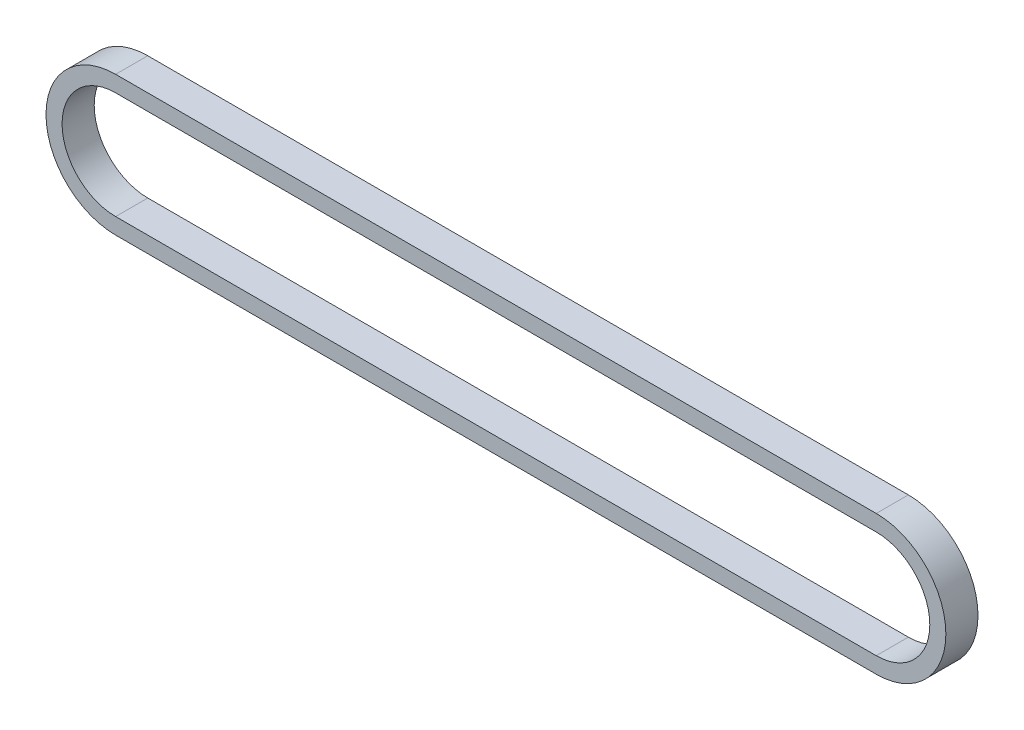
ISO-10303-21;
HEADER;
FILE_DESCRIPTION(('STEP AP214'),'2;1');
FILE_NAME('part.step','',(''),(''),'','','');
FILE_SCHEMA(('AUTOMOTIVE_DESIGN { 1 0 10303 214 1 1 1 1 }'));
ENDSEC;
DATA;
#1=APPLICATION_CONTEXT('core data for automotive mechanical design processes');
#2=APPLICATION_PROTOCOL_DEFINITION('international standard','automotive_design',2000,#1);
#3=PRODUCT_CONTEXT('',#1,'mechanical');
#4=PRODUCT('Part','Part','',(#3));
#5=PRODUCT_RELATED_PRODUCT_CATEGORY('part','',(#4));
#6=PRODUCT_DEFINITION_FORMATION('','',#4);
#7=PRODUCT_DEFINITION_CONTEXT('part definition',#1,'design');
#8=PRODUCT_DEFINITION('design','',#6,#7);
#9=PRODUCT_DEFINITION_SHAPE('','',#8);
#10=(LENGTH_UNIT() NAMED_UNIT(*) SI_UNIT(.MILLI.,.METRE.));
#11=(NAMED_UNIT(*) PLANE_ANGLE_UNIT() SI_UNIT($,.RADIAN.));
#12=(NAMED_UNIT(*) SI_UNIT($,.STERADIAN.) SOLID_ANGLE_UNIT());
#13=UNCERTAINTY_MEASURE_WITH_UNIT(LENGTH_MEASURE(1.E-05),#10,'distance_accuracy_value','');
#14=(GEOMETRIC_REPRESENTATION_CONTEXT(3) GLOBAL_UNCERTAINTY_ASSIGNED_CONTEXT((#13)) GLOBAL_UNIT_ASSIGNED_CONTEXT((#10,
#11,#12)) REPRESENTATION_CONTEXT('',''));
#15=CARTESIAN_POINT('',(0.,0.,0.));
#16=DIRECTION('',(0.,0.,1.));
#17=DIRECTION('',(1.,0.,0.));
#18=AXIS2_PLACEMENT_3D('',#15,#16,#17);
#19=CARTESIAN_POINT('',(-35.5,0.,3.));
#20=DIRECTION('',(0.,0.,1.));
#21=DIRECTION('',(1.,0.,0.));
#22=AXIS2_PLACEMENT_3D('',#19,#20,#21);
#23=PLANE('',#22);
#24=CARTESIAN_POINT('',(-35.5,0.,3.));
#25=DIRECTION('',(0.,0.,1.));
#26=DIRECTION('',(1.,0.,0.));
#27=AXIS2_PLACEMENT_3D('',#24,#25,#26);
#28=CIRCLE('',#27,6.50000000000001);
#29=CARTESIAN_POINT('',(-35.5,6.50000000000001,3.));
#30=VERTEX_POINT('',#29);
#31=CARTESIAN_POINT('',(-35.5,-6.50000000000001,3.));
#32=VERTEX_POINT('',#31);
#33=EDGE_CURVE('E167',#30,#32,#28,.T.);
#34=ORIENTED_EDGE('',*,*,#33,.T.);
#35=DIRECTION('',(1.,0.,0.));
#36=VECTOR('',#35,1.);
#37=CARTESIAN_POINT('',(-35.5,-6.50000000000001,3.));
#38=LINE('',#37,#36);
#39=CARTESIAN_POINT('',(35.5,-6.50000000000001,3.));
#40=VERTEX_POINT('',#39);
#41=EDGE_CURVE('E171',#32,#40,#38,.T.);
#42=ORIENTED_EDGE('',*,*,#41,.T.);
#43=CARTESIAN_POINT('',(35.5,0.,3.));
#44=DIRECTION('',(0.,0.,1.));
#45=DIRECTION('',(1.,0.,0.));
#46=AXIS2_PLACEMENT_3D('',#43,#44,#45);
#47=CIRCLE('',#46,6.50000000000001);
#48=CARTESIAN_POINT('',(35.5,6.50000000000003,3.));
#49=VERTEX_POINT('',#48);
#50=EDGE_CURVE('E174',#40,#49,#47,.T.);
#51=ORIENTED_EDGE('',*,*,#50,.T.);
#52=DIRECTION('',(-1.,0.,0.));
#53=VECTOR('',#52,1.);
#54=CARTESIAN_POINT('',(-35.5,6.50000000000001,3.));
#55=LINE('',#54,#53);
#56=EDGE_CURVE('E177',#49,#30,#55,.T.);
#57=ORIENTED_EDGE('',*,*,#56,.T.);
#58=EDGE_LOOP('',(#34,#42,#51,#57));
#59=FACE_BOUND('',#58,.T.);
#60=DIRECTION('',(1.,0.,0.));
#61=VECTOR('',#60,1.);
#62=CARTESIAN_POINT('',(-35.5,-5.00000000000001,3.));
#63=LINE('',#62,#61);
#64=CARTESIAN_POINT('',(-35.5,-5.00000000000001,3.));
#65=VERTEX_POINT('',#64);
#66=CARTESIAN_POINT('',(35.5,-5.00000000000001,3.));
#67=VERTEX_POINT('',#66);
#68=EDGE_CURVE('E126',#65,#67,#63,.T.);
#69=ORIENTED_EDGE('',*,*,#68,.F.);
#70=CARTESIAN_POINT('',(-35.5,0.,3.));
#71=DIRECTION('',(0.,0.,1.));
#72=DIRECTION('',(1.,0.,0.));
#73=AXIS2_PLACEMENT_3D('',#70,#71,#72);
#74=CIRCLE('',#73,5.00000000000001);
#75=CARTESIAN_POINT('',(-35.5,5.00000000000001,3.));
#76=VERTEX_POINT('',#75);
#77=EDGE_CURVE('E117',#76,#65,#74,.T.);
#78=ORIENTED_EDGE('',*,*,#77,.F.);
#79=DIRECTION('',(-1.,0.,0.));
#80=VECTOR('',#79,1.);
#81=CARTESIAN_POINT('',(-35.5,5.00000000000001,3.));
#82=LINE('',#81,#80);
#83=CARTESIAN_POINT('',(35.5,5.00000000000003,3.));
#84=VERTEX_POINT('',#83);
#85=EDGE_CURVE('E145',#84,#76,#82,.T.);
#86=ORIENTED_EDGE('',*,*,#85,.F.);
#87=CARTESIAN_POINT('',(35.5,0.,3.));
#88=DIRECTION('',(0.,0.,1.));
#89=DIRECTION('',(1.,0.,0.));
#90=AXIS2_PLACEMENT_3D('',#87,#88,#89);
#91=CIRCLE('',#90,5.00000000000001);
#92=EDGE_CURVE('E139',#67,#84,#91,.T.);
#93=ORIENTED_EDGE('',*,*,#92,.F.);
#94=EDGE_LOOP('',(#69,#78,#86,#93));
#95=FACE_BOUND('',#94,.T.);
#96=ADVANCED_FACE('F41',(#59,#95),#23,.T.);
#97=CARTESIAN_POINT('',(-35.5,0.,0.));
#98=DIRECTION('',(0.,0.,1.));
#99=DIRECTION('',(1.,0.,0.));
#100=AXIS2_PLACEMENT_3D('',#97,#98,#99);
#101=PLANE('',#100);
#102=CARTESIAN_POINT('',(-35.5,0.,0.));
#103=DIRECTION('',(0.,0.,1.));
#104=DIRECTION('',(1.,0.,0.));
#105=AXIS2_PLACEMENT_3D('',#102,#103,#104);
#106=CIRCLE('',#105,6.50000000000001);
#107=CARTESIAN_POINT('',(-35.5,6.50000000000001,0.));
#108=VERTEX_POINT('',#107);
#109=CARTESIAN_POINT('',(-35.5,-6.50000000000001,0.));
#110=VERTEX_POINT('',#109);
#111=EDGE_CURVE('E135',#108,#110,#106,.T.);
#112=ORIENTED_EDGE('',*,*,#111,.F.);
#113=DIRECTION('',(-1.,0.,0.));
#114=VECTOR('',#113,1.);
#115=CARTESIAN_POINT('',(-35.5,6.50000000000001,0.));
#116=LINE('',#115,#114);
#117=CARTESIAN_POINT('',(35.5,6.50000000000003,0.));
#118=VERTEX_POINT('',#117);
#119=EDGE_CURVE('E172',#118,#108,#116,.T.);
#120=ORIENTED_EDGE('',*,*,#119,.F.);
#121=CARTESIAN_POINT('',(35.5,0.,0.));
#122=DIRECTION('',(0.,0.,1.));
#123=DIRECTION('',(1.,0.,0.));
#124=AXIS2_PLACEMENT_3D('',#121,#122,#123);
#125=CIRCLE('',#124,6.50000000000001);
#126=CARTESIAN_POINT('',(35.5,-6.50000000000001,0.));
#127=VERTEX_POINT('',#126);
#128=EDGE_CURVE('E186',#127,#118,#125,.T.);
#129=ORIENTED_EDGE('',*,*,#128,.F.);
#130=DIRECTION('',(1.,0.,0.));
#131=VECTOR('',#130,1.);
#132=CARTESIAN_POINT('',(-35.5,-6.50000000000001,0.));
#133=LINE('',#132,#131);
#134=EDGE_CURVE('E184',#110,#127,#133,.T.);
#135=ORIENTED_EDGE('',*,*,#134,.F.);
#136=EDGE_LOOP('',(#112,#120,#129,#135));
#137=FACE_BOUND('',#136,.T.);
#138=CARTESIAN_POINT('',(-35.5,0.,0.));
#139=DIRECTION('',(0.,0.,1.));
#140=DIRECTION('',(1.,0.,0.));
#141=AXIS2_PLACEMENT_3D('',#138,#139,#140);
#142=CIRCLE('',#141,5.00000000000001);
#143=CARTESIAN_POINT('',(-35.5,5.00000000000001,0.));
#144=VERTEX_POINT('',#143);
#145=CARTESIAN_POINT('',(-35.5,-5.00000000000001,0.));
#146=VERTEX_POINT('',#145);
#147=EDGE_CURVE('E67',#144,#146,#142,.T.);
#148=ORIENTED_EDGE('',*,*,#147,.T.);
#149=DIRECTION('',(1.,0.,0.));
#150=VECTOR('',#149,1.);
#151=CARTESIAN_POINT('',(-35.5,-5.00000000000001,0.));
#152=LINE('',#151,#150);
#153=CARTESIAN_POINT('',(35.5,-5.00000000000001,0.));
#154=VERTEX_POINT('',#153);
#155=EDGE_CURVE('E133',#146,#154,#152,.T.);
#156=ORIENTED_EDGE('',*,*,#155,.T.);
#157=CARTESIAN_POINT('',(35.5,0.,0.));
#158=DIRECTION('',(0.,0.,1.));
#159=DIRECTION('',(1.,0.,0.));
#160=AXIS2_PLACEMENT_3D('',#157,#158,#159);
#161=CIRCLE('',#160,5.00000000000001);
#162=CARTESIAN_POINT('',(35.5,5.00000000000003,0.));
#163=VERTEX_POINT('',#162);
#164=EDGE_CURVE('E154',#154,#163,#161,.T.);
#165=ORIENTED_EDGE('',*,*,#164,.T.);
#166=DIRECTION('',(-1.,0.,0.));
#167=VECTOR('',#166,1.);
#168=CARTESIAN_POINT('',(-35.5,5.00000000000001,0.));
#169=LINE('',#168,#167);
#170=EDGE_CURVE('E127',#163,#144,#169,.T.);
#171=ORIENTED_EDGE('',*,*,#170,.T.);
#172=EDGE_LOOP('',(#148,#156,#165,#171));
#173=FACE_BOUND('',#172,.T.);
#174=ADVANCED_FACE('F209',(#137,#173),#101,.F.);
#175=CARTESIAN_POINT('',(-35.5,0.,3.));
#176=DIRECTION('',(0.,0.,-1.));
#177=DIRECTION('',(-1.,0.,0.));
#178=AXIS2_PLACEMENT_3D('',#175,#176,#177);
#179=CYLINDRICAL_SURFACE('',#178,6.50000000000001);
#180=ORIENTED_EDGE('',*,*,#111,.T.);
#181=DIRECTION('',(0.,0.,-1.));
#182=VECTOR('',#181,1.);
#183=CARTESIAN_POINT('',(-35.5,-6.50000000000001,3.));
#184=LINE('',#183,#182);
#185=EDGE_CURVE('E11',#32,#110,#184,.T.);
#186=ORIENTED_EDGE('',*,*,#185,.F.);
#187=ORIENTED_EDGE('',*,*,#33,.F.);
#188=DIRECTION('',(0.,0.,-1.));
#189=VECTOR('',#188,1.);
#190=CARTESIAN_POINT('',(-35.5,6.50000000000001,3.));
#191=LINE('',#190,#189);
#192=EDGE_CURVE('E180',#30,#108,#191,.T.);
#193=ORIENTED_EDGE('',*,*,#192,.T.);
#194=EDGE_LOOP('',(#180,#186,#187,#193));
#195=FACE_BOUND('',#194,.T.);
#196=ADVANCED_FACE('F43',(#195),#179,.T.);
#197=CARTESIAN_POINT('',(-35.5,-6.50000000000001,3.));
#198=DIRECTION('',(0.,1.,0.));
#199=DIRECTION('',(-1.,0.,0.));
#200=AXIS2_PLACEMENT_3D('',#197,#198,#199);
#201=PLANE('',#200);
#202=ORIENTED_EDGE('',*,*,#134,.T.);
#203=DIRECTION('',(0.,0.,-1.));
#204=VECTOR('',#203,1.);
#205=CARTESIAN_POINT('',(35.5,-6.50000000000001,3.));
#206=LINE('',#205,#204);
#207=EDGE_CURVE('E49',#40,#127,#206,.T.);
#208=ORIENTED_EDGE('',*,*,#207,.F.);
#209=ORIENTED_EDGE('',*,*,#41,.F.);
#210=ORIENTED_EDGE('',*,*,#185,.T.);
#211=EDGE_LOOP('',(#202,#208,#209,#210));
#212=FACE_BOUND('',#211,.T.);
#213=ADVANCED_FACE('F219',(#212),#201,.F.);
#214=CARTESIAN_POINT('',(35.5,0.,3.));
#215=DIRECTION('',(0.,0.,-1.));
#216=DIRECTION('',(-1.,0.,0.));
#217=AXIS2_PLACEMENT_3D('',#214,#215,#216);
#218=CYLINDRICAL_SURFACE('',#217,6.50000000000001);
#219=ORIENTED_EDGE('',*,*,#128,.T.);
#220=DIRECTION('',(0.,0.,-1.));
#221=VECTOR('',#220,1.);
#222=CARTESIAN_POINT('',(35.5,6.50000000000003,3.));
#223=LINE('',#222,#221);
#224=EDGE_CURVE('E194',#49,#118,#223,.T.);
#225=ORIENTED_EDGE('',*,*,#224,.F.);
#226=ORIENTED_EDGE('',*,*,#50,.F.);
#227=ORIENTED_EDGE('',*,*,#207,.T.);
#228=EDGE_LOOP('',(#219,#225,#226,#227));
#229=FACE_BOUND('',#228,.T.);
#230=ADVANCED_FACE('F203',(#229),#218,.T.);
#231=CARTESIAN_POINT('',(-35.5,6.50000000000001,3.));
#232=DIRECTION('',(0.,-1.,0.));
#233=DIRECTION('',(1.,0.,0.));
#234=AXIS2_PLACEMENT_3D('',#231,#232,#233);
#235=PLANE('',#234);
#236=ORIENTED_EDGE('',*,*,#119,.T.);
#237=ORIENTED_EDGE('',*,*,#192,.F.);
#238=ORIENTED_EDGE('',*,*,#56,.F.);
#239=ORIENTED_EDGE('',*,*,#224,.T.);
#240=EDGE_LOOP('',(#236,#237,#238,#239));
#241=FACE_BOUND('',#240,.T.);
#242=ADVANCED_FACE('F213',(#241),#235,.F.);
#243=CARTESIAN_POINT('',(-35.5,0.,3.));
#244=DIRECTION('',(0.,0.,-1.));
#245=DIRECTION('',(-1.,0.,0.));
#246=AXIS2_PLACEMENT_3D('',#243,#244,#245);
#247=CYLINDRICAL_SURFACE('',#246,5.00000000000001);
#248=ORIENTED_EDGE('',*,*,#147,.F.);
#249=DIRECTION('',(0.,0.,-1.));
#250=VECTOR('',#249,1.);
#251=CARTESIAN_POINT('',(-35.5,5.00000000000001,3.));
#252=LINE('',#251,#250);
#253=EDGE_CURVE('E121',#76,#144,#252,.T.);
#254=ORIENTED_EDGE('',*,*,#253,.F.);
#255=ORIENTED_EDGE('',*,*,#77,.T.);
#256=DIRECTION('',(0.,0.,-1.));
#257=VECTOR('',#256,1.);
#258=CARTESIAN_POINT('',(-35.5,-5.00000000000001,3.));
#259=LINE('',#258,#257);
#260=EDGE_CURVE('E120',#65,#146,#259,.T.);
#261=ORIENTED_EDGE('',*,*,#260,.T.);
#262=EDGE_LOOP('',(#248,#254,#255,#261));
#263=FACE_BOUND('',#262,.T.);
#264=ADVANCED_FACE('F119',(#263),#247,.F.);
#265=CARTESIAN_POINT('',(-35.5,-5.00000000000001,3.));
#266=DIRECTION('',(0.,1.,0.));
#267=DIRECTION('',(-1.,0.,0.));
#268=AXIS2_PLACEMENT_3D('',#265,#266,#267);
#269=PLANE('',#268);
#270=ORIENTED_EDGE('',*,*,#155,.F.);
#271=ORIENTED_EDGE('',*,*,#260,.F.);
#272=ORIENTED_EDGE('',*,*,#68,.T.);
#273=DIRECTION('',(0.,0.,-1.));
#274=VECTOR('',#273,1.);
#275=CARTESIAN_POINT('',(35.5,-5.00000000000001,3.));
#276=LINE('',#275,#274);
#277=EDGE_CURVE('E136',#67,#154,#276,.T.);
#278=ORIENTED_EDGE('',*,*,#277,.T.);
#279=EDGE_LOOP('',(#270,#271,#272,#278));
#280=FACE_BOUND('',#279,.T.);
#281=ADVANCED_FACE('F130',(#280),#269,.T.);
#282=CARTESIAN_POINT('',(35.5,0.,3.));
#283=DIRECTION('',(0.,0.,-1.));
#284=DIRECTION('',(-1.,0.,0.));
#285=AXIS2_PLACEMENT_3D('',#282,#283,#284);
#286=CYLINDRICAL_SURFACE('',#285,5.00000000000001);
#287=ORIENTED_EDGE('',*,*,#164,.F.);
#288=ORIENTED_EDGE('',*,*,#277,.F.);
#289=ORIENTED_EDGE('',*,*,#92,.T.);
#290=DIRECTION('',(0.,0.,-1.));
#291=VECTOR('',#290,1.);
#292=CARTESIAN_POINT('',(35.5,5.00000000000003,3.));
#293=LINE('',#292,#291);
#294=EDGE_CURVE('E56',#84,#163,#293,.T.);
#295=ORIENTED_EDGE('',*,*,#294,.T.);
#296=EDGE_LOOP('',(#287,#288,#289,#295));
#297=FACE_BOUND('',#296,.T.);
#298=ADVANCED_FACE('F242',(#297),#286,.F.);
#299=CARTESIAN_POINT('',(-35.5,5.00000000000001,3.));
#300=DIRECTION('',(0.,-1.,0.));
#301=DIRECTION('',(1.,0.,0.));
#302=AXIS2_PLACEMENT_3D('',#299,#300,#301);
#303=PLANE('',#302);
#304=ORIENTED_EDGE('',*,*,#170,.F.);
#305=ORIENTED_EDGE('',*,*,#294,.F.);
#306=ORIENTED_EDGE('',*,*,#85,.T.);
#307=ORIENTED_EDGE('',*,*,#253,.T.);
#308=EDGE_LOOP('',(#304,#305,#306,#307));
#309=FACE_BOUND('',#308,.T.);
#310=ADVANCED_FACE('F246',(#309),#303,.T.);
#311=CLOSED_SHELL('',(#96,#174,#196,#213,#230,#242,#264,#281,#298,#310));
#312=MANIFOLD_SOLID_BREP('B2',#311);
#313=ADVANCED_BREP_SHAPE_REPRESENTATION('',(#18,#312),#14);
#314=SHAPE_DEFINITION_REPRESENTATION(#9,#313);
ENDSEC;
END-ISO-10303-21;
